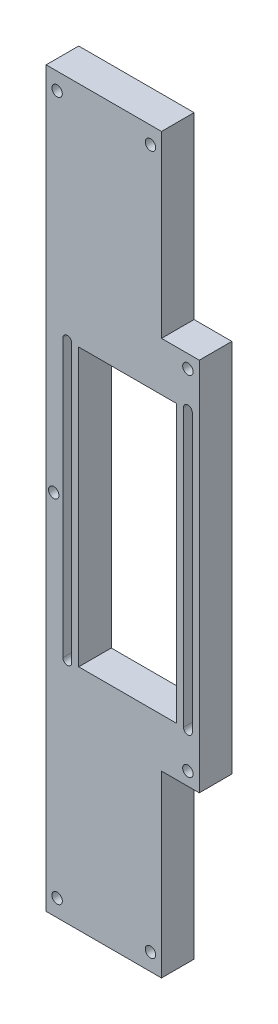
ISO-10303-21;
HEADER;
FILE_DESCRIPTION(('STEP AP214'),'2;1');
FILE_NAME('part.step','',(''),(''),'','','');
FILE_SCHEMA(('AUTOMOTIVE_DESIGN { 1 0 10303 214 1 1 1 1 }'));
ENDSEC;
DATA;
#1=APPLICATION_CONTEXT('core data for automotive mechanical design processes');
#2=APPLICATION_PROTOCOL_DEFINITION('international standard','automotive_design',2000,#1);
#3=PRODUCT_CONTEXT('',#1,'mechanical');
#4=PRODUCT('Part','Part','',(#3));
#5=PRODUCT_RELATED_PRODUCT_CATEGORY('part','',(#4));
#6=PRODUCT_DEFINITION_FORMATION('','',#4);
#7=PRODUCT_DEFINITION_CONTEXT('part definition',#1,'design');
#8=PRODUCT_DEFINITION('design','',#6,#7);
#9=PRODUCT_DEFINITION_SHAPE('','',#8);
#10=(LENGTH_UNIT() NAMED_UNIT(*) SI_UNIT(.MILLI.,.METRE.));
#11=(NAMED_UNIT(*) PLANE_ANGLE_UNIT() SI_UNIT($,.RADIAN.));
#12=(NAMED_UNIT(*) SI_UNIT($,.STERADIAN.) SOLID_ANGLE_UNIT());
#13=UNCERTAINTY_MEASURE_WITH_UNIT(LENGTH_MEASURE(1.E-05),#10,'distance_accuracy_value','');
#14=(GEOMETRIC_REPRESENTATION_CONTEXT(3) GLOBAL_UNCERTAINTY_ASSIGNED_CONTEXT((#13)) GLOBAL_UNIT_ASSIGNED_CONTEXT((#10,
#11,#12)) REPRESENTATION_CONTEXT('',''));
#15=CARTESIAN_POINT('',(0.,0.,0.));
#16=DIRECTION('',(0.,0.,1.));
#17=DIRECTION('',(1.,0.,0.));
#18=AXIS2_PLACEMENT_3D('',#15,#16,#17);
#19=CARTESIAN_POINT('',(-104.394479683541,0.,10.));
#20=DIRECTION('',(1.,0.,0.));
#21=DIRECTION('',(0.,0.,-1.));
#22=AXIS2_PLACEMENT_3D('',#19,#20,#21);
#23=PLANE('',#22);
#24=DIRECTION('',(0.,-1.,0.));
#25=VECTOR('',#24,1.);
#26=CARTESIAN_POINT('',(-104.394479683541,0.,0.));
#27=LINE('',#26,#25);
#28=CARTESIAN_POINT('',(-104.394479683541,189.952675729802,0.));
#29=VERTEX_POINT('',#28);
#30=CARTESIAN_POINT('',(-104.394479683541,104.952675729802,0.));
#31=VERTEX_POINT('',#30);
#32=EDGE_CURVE('E325',#29,#31,#27,.T.);
#33=ORIENTED_EDGE('',*,*,#32,.F.);
#34=DIRECTION('',(0.,0.,-1.));
#35=VECTOR('',#34,1.);
#36=CARTESIAN_POINT('',(-104.394479683541,189.952675729802,10.));
#37=LINE('',#36,#35);
#38=CARTESIAN_POINT('',(-104.394479683541,189.952675729802,10.));
#39=VERTEX_POINT('',#38);
#40=EDGE_CURVE('E11',#39,#29,#37,.T.);
#41=ORIENTED_EDGE('',*,*,#40,.F.);
#42=DIRECTION('',(0.,-1.,0.));
#43=VECTOR('',#42,1.);
#44=CARTESIAN_POINT('',(-104.394479683541,0.,10.));
#45=LINE('',#44,#43);
#46=CARTESIAN_POINT('',(-104.394479683541,104.952675729802,10.));
#47=VERTEX_POINT('',#46);
#48=EDGE_CURVE('E197',#39,#47,#45,.T.);
#49=ORIENTED_EDGE('',*,*,#48,.T.);
#50=DIRECTION('',(0.,0.,-1.));
#51=VECTOR('',#50,1.);
#52=CARTESIAN_POINT('',(-104.394479683541,104.952675729802,10.));
#53=LINE('',#52,#51);
#54=EDGE_CURVE('E59',#47,#31,#53,.T.);
#55=ORIENTED_EDGE('',*,*,#54,.T.);
#56=EDGE_LOOP('',(#33,#41,#49,#55));
#57=FACE_BOUND('',#56,.T.);
#58=ADVANCED_FACE('F40',(#57),#23,.T.);
#59=CARTESIAN_POINT('',(-103.044479683541,189.952675729802,10.));
#60=DIRECTION('',(0.,0.,-1.));
#61=DIRECTION('',(-1.,0.,0.));
#62=AXIS2_PLACEMENT_3D('',#59,#60,#61);
#63=CYLINDRICAL_SURFACE('',#62,1.35);
#64=CARTESIAN_POINT('',(-103.044479683541,189.952675729802,0.));
#65=DIRECTION('',(0.,0.,1.));
#66=DIRECTION('',(1.,0.,0.));
#67=AXIS2_PLACEMENT_3D('',#64,#65,#66);
#68=CIRCLE('',#67,1.35);
#69=CARTESIAN_POINT('',(-101.694479683541,189.952675729802,0.));
#70=VERTEX_POINT('',#69);
#71=EDGE_CURVE('E202',#29,#70,#68,.F.);
#72=ORIENTED_EDGE('',*,*,#71,.T.);
#73=DIRECTION('',(0.,0.,-1.));
#74=VECTOR('',#73,1.);
#75=CARTESIAN_POINT('',(-101.694479683541,189.952675729802,10.));
#76=LINE('',#75,#74);
#77=CARTESIAN_POINT('',(-101.694479683541,189.952675729802,10.));
#78=VERTEX_POINT('',#77);
#79=EDGE_CURVE('E50',#78,#70,#76,.T.);
#80=ORIENTED_EDGE('',*,*,#79,.F.);
#81=CARTESIAN_POINT('',(-103.044479683541,189.952675729802,10.));
#82=DIRECTION('',(0.,0.,1.));
#83=DIRECTION('',(1.,0.,0.));
#84=AXIS2_PLACEMENT_3D('',#81,#82,#83);
#85=CIRCLE('',#84,1.35);
#86=EDGE_CURVE('E192',#39,#78,#85,.F.);
#87=ORIENTED_EDGE('',*,*,#86,.F.);
#88=ORIENTED_EDGE('',*,*,#40,.T.);
#89=EDGE_LOOP('',(#72,#80,#87,#88));
#90=FACE_BOUND('',#89,.T.);
#91=ADVANCED_FACE('F200',(#90),#63,.F.);
#92=CARTESIAN_POINT('',(-101.694479683541,0.,10.));
#93=DIRECTION('',(1.,0.,0.));
#94=DIRECTION('',(0.,0.,-1.));
#95=AXIS2_PLACEMENT_3D('',#92,#93,#94);
#96=PLANE('',#95);
#97=DIRECTION('',(0.,-1.,0.));
#98=VECTOR('',#97,1.);
#99=CARTESIAN_POINT('',(-101.694479683541,0.,0.));
#100=LINE('',#99,#98);
#101=CARTESIAN_POINT('',(-101.694479683541,104.952675729802,0.));
#102=VERTEX_POINT('',#101);
#103=EDGE_CURVE('E328',#70,#102,#100,.T.);
#104=ORIENTED_EDGE('',*,*,#103,.T.);
#105=DIRECTION('',(0.,0.,-1.));
#106=VECTOR('',#105,1.);
#107=CARTESIAN_POINT('',(-101.694479683541,104.952675729802,10.));
#108=LINE('',#107,#106);
#109=CARTESIAN_POINT('',(-101.694479683541,104.952675729802,10.));
#110=VERTEX_POINT('',#109);
#111=EDGE_CURVE('E121',#110,#102,#108,.T.);
#112=ORIENTED_EDGE('',*,*,#111,.F.);
#113=DIRECTION('',(0.,-1.,0.));
#114=VECTOR('',#113,1.);
#115=CARTESIAN_POINT('',(-101.694479683541,0.,10.));
#116=LINE('',#115,#114);
#117=EDGE_CURVE('E184',#78,#110,#116,.T.);
#118=ORIENTED_EDGE('',*,*,#117,.F.);
#119=ORIENTED_EDGE('',*,*,#79,.T.);
#120=EDGE_LOOP('',(#104,#112,#118,#119));
#121=FACE_BOUND('',#120,.T.);
#122=ADVANCED_FACE('F186',(#121),#96,.F.);
#123=CARTESIAN_POINT('',(-67.3944796835408,0.,10.));
#124=DIRECTION('',(1.,0.,0.));
#125=DIRECTION('',(0.,0.,-1.));
#126=AXIS2_PLACEMENT_3D('',#123,#124,#125);
#127=PLANE('',#126);
#128=DIRECTION('',(0.,-1.,0.));
#129=VECTOR('',#128,1.);
#130=CARTESIAN_POINT('',(-67.3944796835408,0.,0.));
#131=LINE('',#130,#129);
#132=CARTESIAN_POINT('',(-67.3944796835408,189.952675729802,0.));
#133=VERTEX_POINT('',#132);
#134=CARTESIAN_POINT('',(-67.3944796835407,104.952675729802,0.));
#135=VERTEX_POINT('',#134);
#136=EDGE_CURVE('E313',#133,#135,#131,.T.);
#137=ORIENTED_EDGE('',*,*,#136,.F.);
#138=DIRECTION('',(0.,0.,-1.));
#139=VECTOR('',#138,1.);
#140=CARTESIAN_POINT('',(-67.3944796835408,189.952675729802,10.));
#141=LINE('',#140,#139);
#142=CARTESIAN_POINT('',(-67.3944796835408,189.952675729802,10.));
#143=VERTEX_POINT('',#142);
#144=EDGE_CURVE('E215',#143,#133,#141,.T.);
#145=ORIENTED_EDGE('',*,*,#144,.F.);
#146=DIRECTION('',(0.,-1.,0.));
#147=VECTOR('',#146,1.);
#148=CARTESIAN_POINT('',(-67.3944796835408,0.,10.));
#149=LINE('',#148,#147);
#150=CARTESIAN_POINT('',(-67.3944796835407,104.952675729802,10.));
#151=VERTEX_POINT('',#150);
#152=EDGE_CURVE('E388',#143,#151,#149,.T.);
#153=ORIENTED_EDGE('',*,*,#152,.T.);
#154=DIRECTION('',(0.,0.,-1.));
#155=VECTOR('',#154,1.);
#156=CARTESIAN_POINT('',(-67.3944796835407,104.952675729802,10.));
#157=LINE('',#156,#155);
#158=EDGE_CURVE('E207',#151,#135,#157,.T.);
#159=ORIENTED_EDGE('',*,*,#158,.T.);
#160=EDGE_LOOP('',(#137,#145,#153,#159));
#161=FACE_BOUND('',#160,.T.);
#162=ADVANCED_FACE('F432',(#161),#127,.T.);
#163=CARTESIAN_POINT('',(-66.0444796835407,189.952675729802,10.));
#164=DIRECTION('',(0.,0.,-1.));
#165=DIRECTION('',(-1.,0.,0.));
#166=AXIS2_PLACEMENT_3D('',#163,#164,#165);
#167=CYLINDRICAL_SURFACE('',#166,1.35);
#168=CARTESIAN_POINT('',(-66.0444796835407,189.952675729802,0.));
#169=DIRECTION('',(0.,0.,1.));
#170=DIRECTION('',(1.,0.,0.));
#171=AXIS2_PLACEMENT_3D('',#168,#169,#170);
#172=CIRCLE('',#171,1.35);
#173=CARTESIAN_POINT('',(-64.6944796835407,189.952675729802,0.));
#174=VERTEX_POINT('',#173);
#175=EDGE_CURVE('E316',#133,#174,#172,.F.);
#176=ORIENTED_EDGE('',*,*,#175,.T.);
#177=DIRECTION('',(0.,0.,-1.));
#178=VECTOR('',#177,1.);
#179=CARTESIAN_POINT('',(-64.6944796835407,189.952675729802,10.));
#180=LINE('',#179,#178);
#181=CARTESIAN_POINT('',(-64.6944796835407,189.952675729802,10.));
#182=VERTEX_POINT('',#181);
#183=EDGE_CURVE('E212',#182,#174,#180,.T.);
#184=ORIENTED_EDGE('',*,*,#183,.F.);
#185=CARTESIAN_POINT('',(-66.0444796835407,189.952675729802,10.));
#186=DIRECTION('',(0.,0.,1.));
#187=DIRECTION('',(1.,0.,0.));
#188=AXIS2_PLACEMENT_3D('',#185,#186,#187);
#189=CIRCLE('',#188,1.35);
#190=EDGE_CURVE('E391',#143,#182,#189,.F.);
#191=ORIENTED_EDGE('',*,*,#190,.F.);
#192=ORIENTED_EDGE('',*,*,#144,.T.);
#193=EDGE_LOOP('',(#176,#184,#191,#192));
#194=FACE_BOUND('',#193,.T.);
#195=ADVANCED_FACE('F428',(#194),#167,.F.);
#196=CARTESIAN_POINT('',(-64.6944796835407,0.,10.));
#197=DIRECTION('',(1.,0.,0.));
#198=DIRECTION('',(0.,0.,-1.));
#199=AXIS2_PLACEMENT_3D('',#196,#197,#198);
#200=PLANE('',#199);
#201=DIRECTION('',(0.,-1.,0.));
#202=VECTOR('',#201,1.);
#203=CARTESIAN_POINT('',(-64.6944796835407,0.,0.));
#204=LINE('',#203,#202);
#205=CARTESIAN_POINT('',(-64.6944796835407,104.952675729802,0.));
#206=VERTEX_POINT('',#205);
#207=EDGE_CURVE('E319',#174,#206,#204,.T.);
#208=ORIENTED_EDGE('',*,*,#207,.T.);
#209=DIRECTION('',(0.,0.,-1.));
#210=VECTOR('',#209,1.);
#211=CARTESIAN_POINT('',(-64.6944796835407,104.952675729802,10.));
#212=LINE('',#211,#210);
#213=CARTESIAN_POINT('',(-64.6944796835407,104.952675729802,10.));
#214=VERTEX_POINT('',#213);
#215=EDGE_CURVE('E209',#214,#206,#212,.T.);
#216=ORIENTED_EDGE('',*,*,#215,.F.);
#217=DIRECTION('',(0.,-1.,0.));
#218=VECTOR('',#217,1.);
#219=CARTESIAN_POINT('',(-64.6944796835407,0.,10.));
#220=LINE('',#219,#218);
#221=EDGE_CURVE('E394',#182,#214,#220,.T.);
#222=ORIENTED_EDGE('',*,*,#221,.F.);
#223=ORIENTED_EDGE('',*,*,#183,.T.);
#224=EDGE_LOOP('',(#208,#216,#222,#223));
#225=FACE_BOUND('',#224,.T.);
#226=ADVANCED_FACE('F424',(#225),#200,.F.);
#227=CARTESIAN_POINT('',(0.,259.952675729802,10.));
#228=DIRECTION('',(0.,1.,0.));
#229=DIRECTION('',(0.,0.,1.));
#230=AXIS2_PLACEMENT_3D('',#227,#228,#229);
#231=PLANE('',#230);
#232=DIRECTION('',(1.,0.,0.));
#233=VECTOR('',#232,1.);
#234=CARTESIAN_POINT('',(0.,259.952675729802,0.));
#235=LINE('',#234,#233);
#236=CARTESIAN_POINT('',(-109.544479683541,259.952675729802,0.));
#237=VERTEX_POINT('',#236);
#238=CARTESIAN_POINT('',(-74.1404200573787,259.952675729802,0.));
#239=VERTEX_POINT('',#238);
#240=EDGE_CURVE('E271',#237,#239,#235,.T.);
#241=ORIENTED_EDGE('',*,*,#240,.F.);
#242=DIRECTION('',(0.,0.,-1.));
#243=VECTOR('',#242,1.);
#244=CARTESIAN_POINT('',(-109.544479683541,259.952675729802,10.));
#245=LINE('',#244,#243);
#246=CARTESIAN_POINT('',(-109.544479683541,259.952675729802,10.));
#247=VERTEX_POINT('',#246);
#248=EDGE_CURVE('E210',#247,#237,#245,.T.);
#249=ORIENTED_EDGE('',*,*,#248,.F.);
#250=DIRECTION('',(1.,0.,0.));
#251=VECTOR('',#250,1.);
#252=CARTESIAN_POINT('',(0.,259.952675729802,10.));
#253=LINE('',#252,#251);
#254=CARTESIAN_POINT('',(-74.1404200573787,259.952675729802,10.));
#255=VERTEX_POINT('',#254);
#256=EDGE_CURVE('E347',#247,#255,#253,.T.);
#257=ORIENTED_EDGE('',*,*,#256,.T.);
#258=DIRECTION('',(0.,0.,-1.));
#259=VECTOR('',#258,1.);
#260=CARTESIAN_POINT('',(-74.1404200573787,259.952675729802,10.));
#261=LINE('',#260,#259);
#262=EDGE_CURVE('E217',#255,#239,#261,.T.);
#263=ORIENTED_EDGE('',*,*,#262,.T.);
#264=EDGE_LOOP('',(#241,#249,#257,#263));
#265=FACE_BOUND('',#264,.T.);
#266=ADVANCED_FACE('F427',(#265),#231,.T.);
#267=CARTESIAN_POINT('',(-109.544479683541,0.,10.));
#268=DIRECTION('',(1.,0.,0.));
#269=DIRECTION('',(0.,0.,-1.));
#270=AXIS2_PLACEMENT_3D('',#267,#268,#269);
#271=PLANE('',#270);
#272=DIRECTION('',(0.,-1.,0.));
#273=VECTOR('',#272,1.);
#274=CARTESIAN_POINT('',(-109.544479683541,0.,0.));
#275=LINE('',#274,#273);
#276=CARTESIAN_POINT('',(-109.544479683541,34.952675729802,0.));
#277=VERTEX_POINT('',#276);
#278=EDGE_CURVE('E274',#237,#277,#275,.T.);
#279=ORIENTED_EDGE('',*,*,#278,.T.);
#280=DIRECTION('',(0.,0.,-1.));
#281=VECTOR('',#280,1.);
#282=CARTESIAN_POINT('',(-109.544479683541,34.952675729802,10.));
#283=LINE('',#282,#281);
#284=CARTESIAN_POINT('',(-109.544479683541,34.952675729802,10.));
#285=VERTEX_POINT('',#284);
#286=EDGE_CURVE('E232',#285,#277,#283,.T.);
#287=ORIENTED_EDGE('',*,*,#286,.F.);
#288=DIRECTION('',(0.,-1.,0.));
#289=VECTOR('',#288,1.);
#290=CARTESIAN_POINT('',(-109.544479683541,0.,10.));
#291=LINE('',#290,#289);
#292=EDGE_CURVE('E350',#247,#285,#291,.T.);
#293=ORIENTED_EDGE('',*,*,#292,.F.);
#294=ORIENTED_EDGE('',*,*,#248,.T.);
#295=EDGE_LOOP('',(#279,#287,#293,#294));
#296=FACE_BOUND('',#295,.T.);
#297=ADVANCED_FACE('F483',(#296),#271,.F.);
#298=CARTESIAN_POINT('',(0.,34.952675729802,10.));
#299=DIRECTION('',(0.,1.,0.));
#300=DIRECTION('',(0.,0.,1.));
#301=AXIS2_PLACEMENT_3D('',#298,#299,#300);
#302=PLANE('',#301);
#303=DIRECTION('',(1.,0.,0.));
#304=VECTOR('',#303,1.);
#305=CARTESIAN_POINT('',(0.,34.952675729802,0.));
#306=LINE('',#305,#304);
#307=CARTESIAN_POINT('',(-74.1404200573787,34.952675729802,0.));
#308=VERTEX_POINT('',#307);
#309=EDGE_CURVE('E277',#277,#308,#306,.T.);
#310=ORIENTED_EDGE('',*,*,#309,.T.);
#311=DIRECTION('',(0.,0.,-1.));
#312=VECTOR('',#311,1.);
#313=CARTESIAN_POINT('',(-74.1404200573787,34.952675729802,10.));
#314=LINE('',#313,#312);
#315=CARTESIAN_POINT('',(-74.1404200573787,34.952675729802,10.));
#316=VERTEX_POINT('',#315);
#317=EDGE_CURVE('E229',#316,#308,#314,.T.);
#318=ORIENTED_EDGE('',*,*,#317,.F.);
#319=DIRECTION('',(1.,0.,0.));
#320=VECTOR('',#319,1.);
#321=CARTESIAN_POINT('',(0.,34.952675729802,10.));
#322=LINE('',#321,#320);
#323=EDGE_CURVE('E353',#285,#316,#322,.T.);
#324=ORIENTED_EDGE('',*,*,#323,.F.);
#325=ORIENTED_EDGE('',*,*,#286,.T.);
#326=EDGE_LOOP('',(#310,#318,#324,#325));
#327=FACE_BOUND('',#326,.T.);
#328=ADVANCED_FACE('F479',(#327),#302,.F.);
#329=CARTESIAN_POINT('',(-74.1404200573787,0.,10.));
#330=DIRECTION('',(-1.,0.,0.));
#331=DIRECTION('',(0.,0.,1.));
#332=AXIS2_PLACEMENT_3D('',#329,#330,#331);
#333=PLANE('',#332);
#334=DIRECTION('',(0.,1.,0.));
#335=VECTOR('',#334,1.);
#336=CARTESIAN_POINT('',(-74.1404200573787,0.,0.));
#337=LINE('',#336,#335);
#338=CARTESIAN_POINT('',(-74.1404200573787,89.952675729802,0.));
#339=VERTEX_POINT('',#338);
#340=EDGE_CURVE('E280',#308,#339,#337,.T.);
#341=ORIENTED_EDGE('',*,*,#340,.T.);
#342=DIRECTION('',(0.,0.,-1.));
#343=VECTOR('',#342,1.);
#344=CARTESIAN_POINT('',(-74.1404200573787,89.952675729802,10.));
#345=LINE('',#344,#343);
#346=CARTESIAN_POINT('',(-74.1404200573787,89.952675729802,10.));
#347=VERTEX_POINT('',#346);
#348=EDGE_CURVE('E226',#347,#339,#345,.T.);
#349=ORIENTED_EDGE('',*,*,#348,.F.);
#350=DIRECTION('',(0.,1.,0.));
#351=VECTOR('',#350,1.);
#352=CARTESIAN_POINT('',(-74.1404200573787,0.,10.));
#353=LINE('',#352,#351);
#354=EDGE_CURVE('E356',#316,#347,#353,.T.);
#355=ORIENTED_EDGE('',*,*,#354,.F.);
#356=ORIENTED_EDGE('',*,*,#317,.T.);
#357=EDGE_LOOP('',(#341,#349,#355,#356));
#358=FACE_BOUND('',#357,.T.);
#359=ADVANCED_FACE('F475',(#358),#333,.F.);
#360=CARTESIAN_POINT('',(0.,89.952675729802,10.));
#361=DIRECTION('',(0.,1.,0.));
#362=DIRECTION('',(0.,0.,1.));
#363=AXIS2_PLACEMENT_3D('',#360,#361,#362);
#364=PLANE('',#363);
#365=DIRECTION('',(1.,0.,0.));
#366=VECTOR('',#365,1.);
#367=CARTESIAN_POINT('',(0.,89.952675729802,0.));
#368=LINE('',#367,#366);
#369=CARTESIAN_POINT('',(-62.5444796835407,89.952675729802,0.));
#370=VERTEX_POINT('',#369);
#371=EDGE_CURVE('E283',#339,#370,#368,.T.);
#372=ORIENTED_EDGE('',*,*,#371,.T.);
#373=DIRECTION('',(0.,0.,-1.));
#374=VECTOR('',#373,1.);
#375=CARTESIAN_POINT('',(-62.5444796835407,89.952675729802,10.));
#376=LINE('',#375,#374);
#377=CARTESIAN_POINT('',(-62.5444796835407,89.952675729802,10.));
#378=VERTEX_POINT('',#377);
#379=EDGE_CURVE('E223',#378,#370,#376,.T.);
#380=ORIENTED_EDGE('',*,*,#379,.F.);
#381=DIRECTION('',(1.,0.,0.));
#382=VECTOR('',#381,1.);
#383=CARTESIAN_POINT('',(0.,89.952675729802,10.));
#384=LINE('',#383,#382);
#385=EDGE_CURVE('E359',#347,#378,#384,.T.);
#386=ORIENTED_EDGE('',*,*,#385,.F.);
#387=ORIENTED_EDGE('',*,*,#348,.T.);
#388=EDGE_LOOP('',(#372,#380,#386,#387));
#389=FACE_BOUND('',#388,.T.);
#390=ADVANCED_FACE('F471',(#389),#364,.F.);
#391=CARTESIAN_POINT('',(-62.5444796835407,0.,10.));
#392=DIRECTION('',(-1.,0.,0.));
#393=DIRECTION('',(0.,-1.,0.));
#394=AXIS2_PLACEMENT_3D('',#391,#392,#393);
#395=PLANE('',#394);
#396=DIRECTION('',(0.,1.,0.));
#397=VECTOR('',#396,1.);
#398=CARTESIAN_POINT('',(-62.5444796835407,0.,0.));
#399=LINE('',#398,#397);
#400=CARTESIAN_POINT('',(-62.5444796835407,204.952675729802,0.));
#401=VERTEX_POINT('',#400);
#402=EDGE_CURVE('E286',#370,#401,#399,.T.);
#403=ORIENTED_EDGE('',*,*,#402,.T.);
#404=DIRECTION('',(0.,0.,-1.));
#405=VECTOR('',#404,1.);
#406=CARTESIAN_POINT('',(-62.5444796835407,204.952675729802,10.));
#407=LINE('',#406,#405);
#408=CARTESIAN_POINT('',(-62.5444796835407,204.952675729802,10.));
#409=VERTEX_POINT('',#408);
#410=EDGE_CURVE('E221',#409,#401,#407,.T.);
#411=ORIENTED_EDGE('',*,*,#410,.F.);
#412=DIRECTION('',(0.,1.,0.));
#413=VECTOR('',#412,1.);
#414=CARTESIAN_POINT('',(-62.5444796835407,0.,10.));
#415=LINE('',#414,#413);
#416=EDGE_CURVE('E362',#378,#409,#415,.T.);
#417=ORIENTED_EDGE('',*,*,#416,.F.);
#418=ORIENTED_EDGE('',*,*,#379,.T.);
#419=EDGE_LOOP('',(#403,#411,#417,#418));
#420=FACE_BOUND('',#419,.T.);
#421=ADVANCED_FACE('F467',(#420),#395,.F.);
#422=CARTESIAN_POINT('',(0.,204.952675729802,10.));
#423=DIRECTION('',(0.,1.,0.));
#424=DIRECTION('',(0.,0.,1.));
#425=AXIS2_PLACEMENT_3D('',#422,#423,#424);
#426=PLANE('',#425);
#427=DIRECTION('',(1.,0.,0.));
#428=VECTOR('',#427,1.);
#429=CARTESIAN_POINT('',(0.,204.952675729802,0.));
#430=LINE('',#429,#428);
#431=CARTESIAN_POINT('',(-74.1404200573787,204.952675729802,0.));
#432=VERTEX_POINT('',#431);
#433=EDGE_CURVE('E289',#432,#401,#430,.T.);
#434=ORIENTED_EDGE('',*,*,#433,.F.);
#435=DIRECTION('',(0.,0.,-1.));
#436=VECTOR('',#435,1.);
#437=CARTESIAN_POINT('',(-74.1404200573787,204.952675729802,10.));
#438=LINE('',#437,#436);
#439=CARTESIAN_POINT('',(-74.1404200573787,204.952675729802,10.));
#440=VERTEX_POINT('',#439);
#441=EDGE_CURVE('E219',#440,#432,#438,.T.);
#442=ORIENTED_EDGE('',*,*,#441,.F.);
#443=DIRECTION('',(1.,0.,0.));
#444=VECTOR('',#443,1.);
#445=CARTESIAN_POINT('',(0.,204.952675729802,10.));
#446=LINE('',#445,#444);
#447=EDGE_CURVE('E364',#440,#409,#446,.T.);
#448=ORIENTED_EDGE('',*,*,#447,.T.);
#449=ORIENTED_EDGE('',*,*,#410,.T.);
#450=EDGE_LOOP('',(#434,#442,#448,#449));
#451=FACE_BOUND('',#450,.T.);
#452=ADVANCED_FACE('F464',(#451),#426,.T.);
#453=CARTESIAN_POINT('',(-99.5444796835407,0.,10.));
#454=DIRECTION('',(1.,0.,0.));
#455=DIRECTION('',(0.,0.,-1.));
#456=AXIS2_PLACEMENT_3D('',#453,#454,#455);
#457=PLANE('',#456);
#458=DIRECTION('',(0.,-1.,0.));
#459=VECTOR('',#458,1.);
#460=CARTESIAN_POINT('',(-99.5444796835407,0.,0.));
#461=LINE('',#460,#459);
#462=CARTESIAN_POINT('',(-99.5444796835407,189.952675729802,0.));
#463=VERTEX_POINT('',#462);
#464=CARTESIAN_POINT('',(-99.5444796835407,104.952675729802,0.));
#465=VERTEX_POINT('',#464);
#466=EDGE_CURVE('E257',#463,#465,#461,.T.);
#467=ORIENTED_EDGE('',*,*,#466,.F.);
#468=DIRECTION('',(0.,0.,-1.));
#469=VECTOR('',#468,1.);
#470=CARTESIAN_POINT('',(-99.5444796835407,189.952675729802,10.));
#471=LINE('',#470,#469);
#472=CARTESIAN_POINT('',(-99.5444796835407,189.952675729802,10.));
#473=VERTEX_POINT('',#472);
#474=EDGE_CURVE('E44',#473,#463,#471,.T.);
#475=ORIENTED_EDGE('',*,*,#474,.F.);
#476=DIRECTION('',(0.,-1.,0.));
#477=VECTOR('',#476,1.);
#478=CARTESIAN_POINT('',(-99.5444796835407,0.,10.));
#479=LINE('',#478,#477);
#480=CARTESIAN_POINT('',(-99.5444796835407,104.952675729802,10.));
#481=VERTEX_POINT('',#480);
#482=EDGE_CURVE('E335',#473,#481,#479,.T.);
#483=ORIENTED_EDGE('',*,*,#482,.T.);
#484=DIRECTION('',(0.,0.,-1.));
#485=VECTOR('',#484,1.);
#486=CARTESIAN_POINT('',(-99.5444796835407,104.952675729802,10.));
#487=LINE('',#486,#485);
#488=EDGE_CURVE('E236',#481,#465,#487,.T.);
#489=ORIENTED_EDGE('',*,*,#488,.T.);
#490=EDGE_LOOP('',(#467,#475,#483,#489));
#491=FACE_BOUND('',#490,.T.);
#492=ADVANCED_FACE('F261',(#491),#457,.T.);
#493=CARTESIAN_POINT('',(0.,189.952675729802,10.));
#494=DIRECTION('',(0.,1.,0.));
#495=DIRECTION('',(0.,0.,1.));
#496=AXIS2_PLACEMENT_3D('',#493,#494,#495);
#497=PLANE('',#496);
#498=DIRECTION('',(1.,0.,0.));
#499=VECTOR('',#498,1.);
#500=CARTESIAN_POINT('',(0.,189.952675729802,0.));
#501=LINE('',#500,#499);
#502=CARTESIAN_POINT('',(-69.5444796835407,189.952675729802,0.));
#503=VERTEX_POINT('',#502);
#504=EDGE_CURVE('E248',#463,#503,#501,.T.);
#505=ORIENTED_EDGE('',*,*,#504,.T.);
#506=DIRECTION('',(0.,0.,-1.));
#507=VECTOR('',#506,1.);
#508=CARTESIAN_POINT('',(-69.5444796835407,189.952675729802,10.));
#509=LINE('',#508,#507);
#510=CARTESIAN_POINT('',(-69.5444796835407,189.952675729802,10.));
#511=VERTEX_POINT('',#510);
#512=EDGE_CURVE('E239',#511,#503,#509,.T.);
#513=ORIENTED_EDGE('',*,*,#512,.F.);
#514=DIRECTION('',(1.,0.,0.));
#515=VECTOR('',#514,1.);
#516=CARTESIAN_POINT('',(0.,189.952675729802,10.));
#517=LINE('',#516,#515);
#518=EDGE_CURVE('E250',#473,#511,#517,.T.);
#519=ORIENTED_EDGE('',*,*,#518,.F.);
#520=ORIENTED_EDGE('',*,*,#474,.T.);
#521=EDGE_LOOP('',(#505,#513,#519,#520));
#522=FACE_BOUND('',#521,.T.);
#523=ADVANCED_FACE('F247',(#522),#497,.F.);
#524=CARTESIAN_POINT('',(-69.5444796835407,0.,10.));
#525=DIRECTION('',(-1.,0.,0.));
#526=DIRECTION('',(0.,-1.,0.));
#527=AXIS2_PLACEMENT_3D('',#524,#525,#526);
#528=PLANE('',#527);
#529=DIRECTION('',(0.,1.,0.));
#530=VECTOR('',#529,1.);
#531=CARTESIAN_POINT('',(-69.5444796835407,0.,0.));
#532=LINE('',#531,#530);
#533=CARTESIAN_POINT('',(-69.5444796835407,104.952675729802,0.));
#534=VERTEX_POINT('',#533);
#535=EDGE_CURVE('E259',#534,#503,#532,.T.);
#536=ORIENTED_EDGE('',*,*,#535,.F.);
#537=DIRECTION('',(0.,0.,-1.));
#538=VECTOR('',#537,1.);
#539=CARTESIAN_POINT('',(-69.5444796835407,104.952675729802,10.));
#540=LINE('',#539,#538);
#541=CARTESIAN_POINT('',(-69.5444796835407,104.952675729802,10.));
#542=VERTEX_POINT('',#541);
#543=EDGE_CURVE('E238',#542,#534,#540,.T.);
#544=ORIENTED_EDGE('',*,*,#543,.F.);
#545=DIRECTION('',(0.,1.,0.));
#546=VECTOR('',#545,1.);
#547=CARTESIAN_POINT('',(-69.5444796835407,0.,10.));
#548=LINE('',#547,#546);
#549=EDGE_CURVE('E342',#542,#511,#548,.T.);
#550=ORIENTED_EDGE('',*,*,#549,.T.);
#551=ORIENTED_EDGE('',*,*,#512,.T.);
#552=EDGE_LOOP('',(#536,#544,#550,#551));
#553=FACE_BOUND('',#552,.T.);
#554=ADVANCED_FACE('F422',(#553),#528,.T.);
#555=CARTESIAN_POINT('',(-66.0444796835407,104.952675729802,10.));
#556=DIRECTION('',(0.,0.,-1.));
#557=DIRECTION('',(-1.,0.,0.));
#558=AXIS2_PLACEMENT_3D('',#555,#556,#557);
#559=CYLINDRICAL_SURFACE('',#558,1.35);
#560=CARTESIAN_POINT('',(-66.0444796835407,104.952675729802,0.));
#561=DIRECTION('',(0.,0.,1.));
#562=DIRECTION('',(1.,0.,0.));
#563=AXIS2_PLACEMENT_3D('',#560,#561,#562);
#564=CIRCLE('',#563,1.35);
#565=EDGE_CURVE('E322',#135,#206,#564,.T.);
#566=ORIENTED_EDGE('',*,*,#565,.F.);
#567=ORIENTED_EDGE('',*,*,#158,.F.);
#568=CARTESIAN_POINT('',(-66.0444796835407,104.952675729802,10.));
#569=DIRECTION('',(0.,0.,1.));
#570=DIRECTION('',(1.,0.,0.));
#571=AXIS2_PLACEMENT_3D('',#568,#569,#570);
#572=CIRCLE('',#571,1.35);
#573=EDGE_CURVE('E396',#151,#214,#572,.T.);
#574=ORIENTED_EDGE('',*,*,#573,.T.);
#575=ORIENTED_EDGE('',*,*,#215,.T.);
#576=EDGE_LOOP('',(#566,#567,#574,#575));
#577=FACE_BOUND('',#576,.T.);
#578=ADVANCED_FACE('F418',(#577),#559,.F.);
#579=CARTESIAN_POINT('',(-106.178709834788,254.723971913458,10.));
#580=DIRECTION('',(0.,0.,-1.));
#581=DIRECTION('',(-1.,0.,0.));
#582=AXIS2_PLACEMENT_3D('',#579,#580,#581);
#583=CYLINDRICAL_SURFACE('',#582,1.59999999999999);
#584=CARTESIAN_POINT('',(-106.178709834788,254.723971913458,10.));
#585=DIRECTION('',(0.,0.,1.));
#586=DIRECTION('',(1.,0.,0.));
#587=AXIS2_PLACEMENT_3D('',#584,#585,#586);
#588=CIRCLE('',#587,1.59999999999999);
#589=CARTESIAN_POINT('',(-104.578709834788,254.723971913458,10.));
#590=VERTEX_POINT('',#589);
#591=EDGE_CURVE('E385',#590,#590,#588,.F.);
#592=ORIENTED_EDGE('',*,*,#591,.F.);
#593=EDGE_LOOP('',(#592));
#594=FACE_BOUND('',#593,.T.);
#595=CARTESIAN_POINT('',(-106.178709834788,254.723971913458,0.));
#596=DIRECTION('',(0.,0.,1.));
#597=DIRECTION('',(1.,0.,0.));
#598=AXIS2_PLACEMENT_3D('',#595,#596,#597);
#599=CIRCLE('',#598,1.59999999999999);
#600=CARTESIAN_POINT('',(-104.578709834788,254.723971913458,0.));
#601=VERTEX_POINT('',#600);
#602=EDGE_CURVE('E310',#601,#601,#599,.F.);
#603=ORIENTED_EDGE('',*,*,#602,.T.);
#604=EDGE_LOOP('',(#603));
#605=FACE_BOUND('',#604,.T.);
#606=ADVANCED_FACE('F421',(#594,#605),#583,.F.);
#607=CARTESIAN_POINT('',(-66.0444796835407,200.885606030722,10.));
#608=DIRECTION('',(0.,0.,-1.));
#609=DIRECTION('',(-1.,0.,0.));
#610=AXIS2_PLACEMENT_3D('',#607,#608,#609);
#611=CYLINDRICAL_SURFACE('',#610,1.6);
#612=CARTESIAN_POINT('',(-66.0444796835407,200.885606030722,10.));
#613=DIRECTION('',(0.,0.,1.));
#614=DIRECTION('',(1.,0.,0.));
#615=AXIS2_PLACEMENT_3D('',#612,#613,#614);
#616=CIRCLE('',#615,1.6);
#617=CARTESIAN_POINT('',(-64.4444796835407,200.885606030722,10.));
#618=VERTEX_POINT('',#617);
#619=EDGE_CURVE('E382',#618,#618,#616,.F.);
#620=ORIENTED_EDGE('',*,*,#619,.F.);
#621=EDGE_LOOP('',(#620));
#622=FACE_BOUND('',#621,.T.);
#623=CARTESIAN_POINT('',(-66.0444796835407,200.885606030722,0.));
#624=DIRECTION('',(0.,0.,1.));
#625=DIRECTION('',(1.,0.,0.));
#626=AXIS2_PLACEMENT_3D('',#623,#624,#625);
#627=CIRCLE('',#626,1.6);
#628=CARTESIAN_POINT('',(-64.4444796835407,200.885606030722,0.));
#629=VERTEX_POINT('',#628);
#630=EDGE_CURVE('E307',#629,#629,#627,.F.);
#631=ORIENTED_EDGE('',*,*,#630,.T.);
#632=EDGE_LOOP('',(#631));
#633=FACE_BOUND('',#632,.T.);
#634=ADVANCED_FACE('F439',(#622,#633),#611,.F.);
#635=CARTESIAN_POINT('',(-107.209755900516,147.452675729802,10.));
#636=DIRECTION('',(0.,0.,-1.));
#637=DIRECTION('',(-1.,0.,0.));
#638=AXIS2_PLACEMENT_3D('',#635,#636,#637);
#639=CYLINDRICAL_SURFACE('',#638,1.6);
#640=CARTESIAN_POINT('',(-107.209755900516,147.452675729802,10.));
#641=DIRECTION('',(0.,0.,1.));
#642=DIRECTION('',(1.,0.,0.));
#643=AXIS2_PLACEMENT_3D('',#640,#641,#642);
#644=CIRCLE('',#643,1.6);
#645=CARTESIAN_POINT('',(-105.609755900516,147.452675729802,10.));
#646=VERTEX_POINT('',#645);
#647=EDGE_CURVE('E379',#646,#646,#644,.T.);
#648=ORIENTED_EDGE('',*,*,#647,.T.);
#649=EDGE_LOOP('',(#648));
#650=FACE_BOUND('',#649,.T.);
#651=CARTESIAN_POINT('',(-107.209755900516,147.452675729802,0.));
#652=DIRECTION('',(0.,0.,1.));
#653=DIRECTION('',(1.,0.,0.));
#654=AXIS2_PLACEMENT_3D('',#651,#652,#653);
#655=CIRCLE('',#654,1.6);
#656=CARTESIAN_POINT('',(-105.609755900516,147.452675729802,0.));
#657=VERTEX_POINT('',#656);
#658=EDGE_CURVE('E304',#657,#657,#655,.T.);
#659=ORIENTED_EDGE('',*,*,#658,.F.);
#660=EDGE_LOOP('',(#659));
#661=FACE_BOUND('',#660,.T.);
#662=ADVANCED_FACE('F443',(#650,#661),#639,.F.);
#663=CARTESIAN_POINT('',(-66.0444796835407,94.0197454288817,10.));
#664=DIRECTION('',(0.,0.,-1.));
#665=DIRECTION('',(-1.,0.,0.));
#666=AXIS2_PLACEMENT_3D('',#663,#664,#665);
#667=CYLINDRICAL_SURFACE('',#666,1.60000000000001);
#668=CARTESIAN_POINT('',(-66.0444796835407,94.0197454288817,10.));
#669=DIRECTION('',(0.,0.,1.));
#670=DIRECTION('',(1.,0.,0.));
#671=AXIS2_PLACEMENT_3D('',#668,#669,#670);
#672=CIRCLE('',#671,1.60000000000001);
#673=CARTESIAN_POINT('',(-64.4444796835407,94.0197454288817,10.));
#674=VERTEX_POINT('',#673);
#675=EDGE_CURVE('E376',#674,#674,#672,.T.);
#676=ORIENTED_EDGE('',*,*,#675,.T.);
#677=EDGE_LOOP('',(#676));
#678=FACE_BOUND('',#677,.T.);
#679=CARTESIAN_POINT('',(-66.0444796835407,94.0197454288817,0.));
#680=DIRECTION('',(0.,0.,1.));
#681=DIRECTION('',(1.,0.,0.));
#682=AXIS2_PLACEMENT_3D('',#679,#680,#681);
#683=CIRCLE('',#682,1.60000000000001);
#684=CARTESIAN_POINT('',(-64.4444796835407,94.0197454288817,0.));
#685=VERTEX_POINT('',#684);
#686=EDGE_CURVE('E301',#685,#685,#683,.T.);
#687=ORIENTED_EDGE('',*,*,#686,.F.);
#688=EDGE_LOOP('',(#687));
#689=FACE_BOUND('',#688,.T.);
#690=ADVANCED_FACE('F447',(#678,#689),#667,.F.);
#691=CARTESIAN_POINT('',(-77.5192503583802,40.1813795461459,10.));
#692=DIRECTION('',(0.,0.,-1.));
#693=DIRECTION('',(-1.,0.,0.));
#694=AXIS2_PLACEMENT_3D('',#691,#692,#693);
#695=CYLINDRICAL_SURFACE('',#694,1.6);
#696=CARTESIAN_POINT('',(-77.5192503583802,40.1813795461459,10.));
#697=DIRECTION('',(0.,0.,1.));
#698=DIRECTION('',(1.,0.,0.));
#699=AXIS2_PLACEMENT_3D('',#696,#697,#698);
#700=CIRCLE('',#699,1.6);
#701=CARTESIAN_POINT('',(-75.9192503583802,40.1813795461459,10.));
#702=VERTEX_POINT('',#701);
#703=EDGE_CURVE('E373',#702,#702,#700,.T.);
#704=ORIENTED_EDGE('',*,*,#703,.T.);
#705=EDGE_LOOP('',(#704));
#706=FACE_BOUND('',#705,.T.);
#707=CARTESIAN_POINT('',(-77.5192503583802,40.1813795461459,0.));
#708=DIRECTION('',(0.,0.,1.));
#709=DIRECTION('',(1.,0.,0.));
#710=AXIS2_PLACEMENT_3D('',#707,#708,#709);
#711=CIRCLE('',#710,1.6);
#712=CARTESIAN_POINT('',(-75.9192503583802,40.1813795461459,0.));
#713=VERTEX_POINT('',#712);
#714=EDGE_CURVE('E298',#713,#713,#711,.T.);
#715=ORIENTED_EDGE('',*,*,#714,.F.);
#716=EDGE_LOOP('',(#715));
#717=FACE_BOUND('',#716,.T.);
#718=ADVANCED_FACE('F451',(#706,#717),#695,.F.);
#719=CARTESIAN_POINT('',(-106.178709834788,40.1813795461459,10.));
#720=DIRECTION('',(0.,0.,-1.));
#721=DIRECTION('',(-1.,0.,0.));
#722=AXIS2_PLACEMENT_3D('',#719,#720,#721);
#723=CYLINDRICAL_SURFACE('',#722,1.6);
#724=CARTESIAN_POINT('',(-106.178709834788,40.1813795461459,10.));
#725=DIRECTION('',(0.,0.,1.));
#726=DIRECTION('',(1.,0.,0.));
#727=AXIS2_PLACEMENT_3D('',#724,#725,#726);
#728=CIRCLE('',#727,1.6);
#729=CARTESIAN_POINT('',(-104.578709834788,40.1813795461459,10.));
#730=VERTEX_POINT('',#729);
#731=EDGE_CURVE('E370',#730,#730,#728,.T.);
#732=ORIENTED_EDGE('',*,*,#731,.T.);
#733=EDGE_LOOP('',(#732));
#734=FACE_BOUND('',#733,.T.);
#735=CARTESIAN_POINT('',(-106.178709834788,40.1813795461459,0.));
#736=DIRECTION('',(0.,0.,1.));
#737=DIRECTION('',(1.,0.,0.));
#738=AXIS2_PLACEMENT_3D('',#735,#736,#737);
#739=CIRCLE('',#738,1.6);
#740=CARTESIAN_POINT('',(-104.578709834788,40.1813795461459,0.));
#741=VERTEX_POINT('',#740);
#742=EDGE_CURVE('E295',#741,#741,#739,.T.);
#743=ORIENTED_EDGE('',*,*,#742,.F.);
#744=EDGE_LOOP('',(#743));
#745=FACE_BOUND('',#744,.T.);
#746=ADVANCED_FACE('F455',(#734,#745),#723,.F.);
#747=CARTESIAN_POINT('',(-74.1404200573787,0.,10.));
#748=DIRECTION('',(1.,0.,0.));
#749=DIRECTION('',(0.,0.,-1.));
#750=AXIS2_PLACEMENT_3D('',#747,#748,#749);
#751=PLANE('',#750);
#752=DIRECTION('',(0.,-1.,0.));
#753=VECTOR('',#752,1.);
#754=CARTESIAN_POINT('',(-74.1404200573787,0.,0.));
#755=LINE('',#754,#753);
#756=EDGE_CURVE('E292',#239,#432,#755,.T.);
#757=ORIENTED_EDGE('',*,*,#756,.F.);
#758=ORIENTED_EDGE('',*,*,#262,.F.);
#759=DIRECTION('',(0.,-1.,0.));
#760=VECTOR('',#759,1.);
#761=CARTESIAN_POINT('',(-74.1404200573787,0.,10.));
#762=LINE('',#761,#760);
#763=EDGE_CURVE('E367',#255,#440,#762,.T.);
#764=ORIENTED_EDGE('',*,*,#763,.T.);
#765=ORIENTED_EDGE('',*,*,#441,.T.);
#766=EDGE_LOOP('',(#757,#758,#764,#765));
#767=FACE_BOUND('',#766,.T.);
#768=ADVANCED_FACE('F459',(#767),#751,.T.);
#769=CARTESIAN_POINT('',(0.,104.952675729802,10.));
#770=DIRECTION('',(0.,1.,0.));
#771=DIRECTION('',(0.,0.,1.));
#772=AXIS2_PLACEMENT_3D('',#769,#770,#771);
#773=PLANE('',#772);
#774=DIRECTION('',(1.,0.,0.));
#775=VECTOR('',#774,1.);
#776=CARTESIAN_POINT('',(0.,104.952675729802,0.));
#777=LINE('',#776,#775);
#778=EDGE_CURVE('E269',#465,#534,#777,.T.);
#779=ORIENTED_EDGE('',*,*,#778,.F.);
#780=ORIENTED_EDGE('',*,*,#488,.F.);
#781=DIRECTION('',(1.,0.,0.));
#782=VECTOR('',#781,1.);
#783=CARTESIAN_POINT('',(0.,104.952675729802,10.));
#784=LINE('',#783,#782);
#785=EDGE_CURVE('E344',#481,#542,#784,.T.);
#786=ORIENTED_EDGE('',*,*,#785,.T.);
#787=ORIENTED_EDGE('',*,*,#543,.T.);
#788=EDGE_LOOP('',(#779,#780,#786,#787));
#789=FACE_BOUND('',#788,.T.);
#790=ADVANCED_FACE('F407',(#789),#773,.T.);
#791=CARTESIAN_POINT('',(-77.5192503583803,254.723971913458,10.));
#792=DIRECTION('',(0.,0.,-1.));
#793=DIRECTION('',(-1.,0.,0.));
#794=AXIS2_PLACEMENT_3D('',#791,#792,#793);
#795=CYLINDRICAL_SURFACE('',#794,1.59999999999999);
#796=CARTESIAN_POINT('',(-77.5192503583803,254.723971913458,10.));
#797=DIRECTION('',(0.,0.,1.));
#798=DIRECTION('',(1.,0.,0.));
#799=AXIS2_PLACEMENT_3D('',#796,#797,#798);
#800=CIRCLE('',#799,1.59999999999999);
#801=CARTESIAN_POINT('',(-75.9192503583803,254.723971913458,10.));
#802=VERTEX_POINT('',#801);
#803=EDGE_CURVE('E332',#802,#802,#800,.F.);
#804=ORIENTED_EDGE('',*,*,#803,.F.);
#805=EDGE_LOOP('',(#804));
#806=FACE_BOUND('',#805,.T.);
#807=CARTESIAN_POINT('',(-77.5192503583803,254.723971913458,0.));
#808=DIRECTION('',(0.,0.,1.));
#809=DIRECTION('',(1.,0.,0.));
#810=AXIS2_PLACEMENT_3D('',#807,#808,#809);
#811=CIRCLE('',#810,1.59999999999999);
#812=CARTESIAN_POINT('',(-75.9192503583803,254.723971913458,0.));
#813=VERTEX_POINT('',#812);
#814=EDGE_CURVE('E262',#813,#813,#811,.F.);
#815=ORIENTED_EDGE('',*,*,#814,.T.);
#816=EDGE_LOOP('',(#815));
#817=FACE_BOUND('',#816,.T.);
#818=ADVANCED_FACE('F42',(#806,#817),#795,.F.);
#819=CARTESIAN_POINT('',(-103.044479683541,104.952675729802,10.));
#820=DIRECTION('',(0.,0.,-1.));
#821=DIRECTION('',(-1.,0.,0.));
#822=AXIS2_PLACEMENT_3D('',#819,#820,#821);
#823=CYLINDRICAL_SURFACE('',#822,1.35);
#824=CARTESIAN_POINT('',(-103.044479683541,104.952675729802,0.));
#825=DIRECTION('',(0.,0.,1.));
#826=DIRECTION('',(1.,0.,0.));
#827=AXIS2_PLACEMENT_3D('',#824,#825,#826);
#828=CIRCLE('',#827,1.35);
#829=EDGE_CURVE('E330',#31,#102,#828,.T.);
#830=ORIENTED_EDGE('',*,*,#829,.F.);
#831=ORIENTED_EDGE('',*,*,#54,.F.);
#832=CARTESIAN_POINT('',(-103.044479683541,104.952675729802,10.));
#833=DIRECTION('',(0.,0.,1.));
#834=DIRECTION('',(1.,0.,0.));
#835=AXIS2_PLACEMENT_3D('',#832,#833,#834);
#836=CIRCLE('',#835,1.35);
#837=EDGE_CURVE('E191',#47,#110,#836,.T.);
#838=ORIENTED_EDGE('',*,*,#837,.T.);
#839=ORIENTED_EDGE('',*,*,#111,.T.);
#840=EDGE_LOOP('',(#830,#831,#838,#839));
#841=FACE_BOUND('',#840,.T.);
#842=ADVANCED_FACE('F399',(#841),#823,.F.);
#843=CARTESIAN_POINT('',(0.,0.,10.));
#844=DIRECTION('',(0.,0.,1.));
#845=DIRECTION('',(1.,0.,0.));
#846=AXIS2_PLACEMENT_3D('',#843,#844,#845);
#847=PLANE('',#846);
#848=ORIENTED_EDGE('',*,*,#803,.T.);
#849=EDGE_LOOP('',(#848));
#850=FACE_BOUND('',#849,.T.);
#851=ORIENTED_EDGE('',*,*,#482,.F.);
#852=ORIENTED_EDGE('',*,*,#518,.T.);
#853=ORIENTED_EDGE('',*,*,#549,.F.);
#854=ORIENTED_EDGE('',*,*,#785,.F.);
#855=EDGE_LOOP('',(#851,#852,#853,#854));
#856=FACE_BOUND('',#855,.T.);
#857=ORIENTED_EDGE('',*,*,#256,.F.);
#858=ORIENTED_EDGE('',*,*,#292,.T.);
#859=ORIENTED_EDGE('',*,*,#323,.T.);
#860=ORIENTED_EDGE('',*,*,#354,.T.);
#861=ORIENTED_EDGE('',*,*,#385,.T.);
#862=ORIENTED_EDGE('',*,*,#416,.T.);
#863=ORIENTED_EDGE('',*,*,#447,.F.);
#864=ORIENTED_EDGE('',*,*,#763,.F.);
#865=EDGE_LOOP('',(#857,#858,#859,#860,#861,#862,#863,#864));
#866=FACE_BOUND('',#865,.T.);
#867=ORIENTED_EDGE('',*,*,#731,.F.);
#868=EDGE_LOOP('',(#867));
#869=FACE_BOUND('',#868,.T.);
#870=ORIENTED_EDGE('',*,*,#703,.F.);
#871=EDGE_LOOP('',(#870));
#872=FACE_BOUND('',#871,.T.);
#873=ORIENTED_EDGE('',*,*,#675,.F.);
#874=EDGE_LOOP('',(#873));
#875=FACE_BOUND('',#874,.T.);
#876=ORIENTED_EDGE('',*,*,#647,.F.);
#877=EDGE_LOOP('',(#876));
#878=FACE_BOUND('',#877,.T.);
#879=ORIENTED_EDGE('',*,*,#619,.T.);
#880=EDGE_LOOP('',(#879));
#881=FACE_BOUND('',#880,.T.);
#882=ORIENTED_EDGE('',*,*,#591,.T.);
#883=EDGE_LOOP('',(#882));
#884=FACE_BOUND('',#883,.T.);
#885=ORIENTED_EDGE('',*,*,#152,.F.);
#886=ORIENTED_EDGE('',*,*,#190,.T.);
#887=ORIENTED_EDGE('',*,*,#221,.T.);
#888=ORIENTED_EDGE('',*,*,#573,.F.);
#889=EDGE_LOOP('',(#885,#886,#887,#888));
#890=FACE_BOUND('',#889,.T.);
#891=ORIENTED_EDGE('',*,*,#48,.F.);
#892=ORIENTED_EDGE('',*,*,#86,.T.);
#893=ORIENTED_EDGE('',*,*,#117,.T.);
#894=ORIENTED_EDGE('',*,*,#837,.F.);
#895=EDGE_LOOP('',(#891,#892,#893,#894));
#896=FACE_BOUND('',#895,.T.);
#897=ADVANCED_FACE('F196',(#850,#856,#866,#869,#872,#875,#878,#881,#884,#890,#896),#847,.T.);
#898=CARTESIAN_POINT('',(0.,0.,0.));
#899=DIRECTION('',(0.,0.,1.));
#900=DIRECTION('',(1.,0.,0.));
#901=AXIS2_PLACEMENT_3D('',#898,#899,#900);
#902=PLANE('',#901);
#903=ORIENTED_EDGE('',*,*,#814,.F.);
#904=EDGE_LOOP('',(#903));
#905=FACE_BOUND('',#904,.T.);
#906=ORIENTED_EDGE('',*,*,#466,.T.);
#907=ORIENTED_EDGE('',*,*,#778,.T.);
#908=ORIENTED_EDGE('',*,*,#535,.T.);
#909=ORIENTED_EDGE('',*,*,#504,.F.);
#910=EDGE_LOOP('',(#906,#907,#908,#909));
#911=FACE_BOUND('',#910,.T.);
#912=ORIENTED_EDGE('',*,*,#240,.T.);
#913=ORIENTED_EDGE('',*,*,#756,.T.);
#914=ORIENTED_EDGE('',*,*,#433,.T.);
#915=ORIENTED_EDGE('',*,*,#402,.F.);
#916=ORIENTED_EDGE('',*,*,#371,.F.);
#917=ORIENTED_EDGE('',*,*,#340,.F.);
#918=ORIENTED_EDGE('',*,*,#309,.F.);
#919=ORIENTED_EDGE('',*,*,#278,.F.);
#920=EDGE_LOOP('',(#912,#913,#914,#915,#916,#917,#918,#919));
#921=FACE_BOUND('',#920,.T.);
#922=ORIENTED_EDGE('',*,*,#742,.T.);
#923=EDGE_LOOP('',(#922));
#924=FACE_BOUND('',#923,.T.);
#925=ORIENTED_EDGE('',*,*,#714,.T.);
#926=EDGE_LOOP('',(#925));
#927=FACE_BOUND('',#926,.T.);
#928=ORIENTED_EDGE('',*,*,#686,.T.);
#929=EDGE_LOOP('',(#928));
#930=FACE_BOUND('',#929,.T.);
#931=ORIENTED_EDGE('',*,*,#658,.T.);
#932=EDGE_LOOP('',(#931));
#933=FACE_BOUND('',#932,.T.);
#934=ORIENTED_EDGE('',*,*,#630,.F.);
#935=EDGE_LOOP('',(#934));
#936=FACE_BOUND('',#935,.T.);
#937=ORIENTED_EDGE('',*,*,#602,.F.);
#938=EDGE_LOOP('',(#937));
#939=FACE_BOUND('',#938,.T.);
#940=ORIENTED_EDGE('',*,*,#136,.T.);
#941=ORIENTED_EDGE('',*,*,#565,.T.);
#942=ORIENTED_EDGE('',*,*,#207,.F.);
#943=ORIENTED_EDGE('',*,*,#175,.F.);
#944=EDGE_LOOP('',(#940,#941,#942,#943));
#945=FACE_BOUND('',#944,.T.);
#946=ORIENTED_EDGE('',*,*,#32,.T.);
#947=ORIENTED_EDGE('',*,*,#829,.T.);
#948=ORIENTED_EDGE('',*,*,#103,.F.);
#949=ORIENTED_EDGE('',*,*,#71,.F.);
#950=EDGE_LOOP('',(#946,#947,#948,#949));
#951=FACE_BOUND('',#950,.T.);
#952=ADVANCED_FACE('F254',(#905,#911,#921,#924,#927,#930,#933,#936,#939,#945,#951),#902,.F.);
#953=CLOSED_SHELL('',(#58,#91,#122,#162,#195,#226,#266,#297,#328,#359,#390,#421,#452,#492,#523,
#554,#578,#606,#634,#662,#690,#718,#746,#768,#790,#818,#842,#897,#952));
#954=MANIFOLD_SOLID_BREP('B2',#953);
#955=ADVANCED_BREP_SHAPE_REPRESENTATION('',(#18,#954),#14);
#956=SHAPE_DEFINITION_REPRESENTATION(#9,#955);
ENDSEC;
END-ISO-10303-21;
